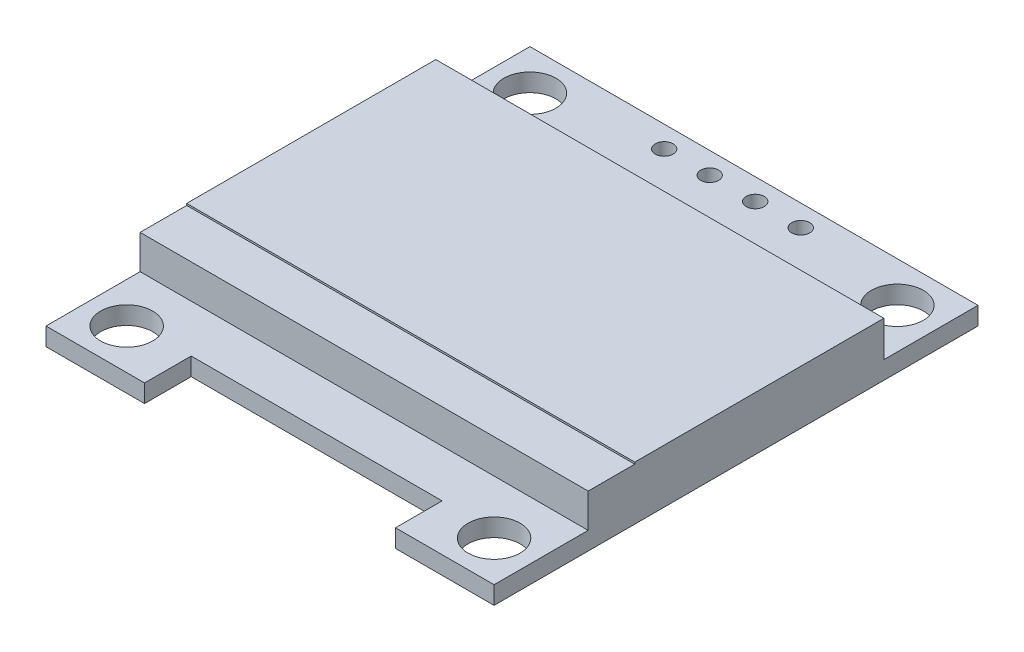
ISO-10303-21;
HEADER;
FILE_DESCRIPTION(('STEP AP214'),'2;1');
FILE_NAME('part.step','',(''),(''),'','','');
FILE_SCHEMA(('AUTOMOTIVE_DESIGN { 1 0 10303 214 1 1 1 1 }'));
ENDSEC;
DATA;
#1=APPLICATION_CONTEXT('core data for automotive mechanical design processes');
#2=APPLICATION_PROTOCOL_DEFINITION('international standard','automotive_design',2000,#1);
#3=PRODUCT_CONTEXT('',#1,'mechanical');
#4=PRODUCT('Part','Part','',(#3));
#5=PRODUCT_RELATED_PRODUCT_CATEGORY('part','',(#4));
#6=PRODUCT_DEFINITION_FORMATION('','',#4);
#7=PRODUCT_DEFINITION_CONTEXT('part definition',#1,'design');
#8=PRODUCT_DEFINITION('design','',#6,#7);
#9=PRODUCT_DEFINITION_SHAPE('','',#8);
#10=(LENGTH_UNIT() NAMED_UNIT(*) SI_UNIT(.MILLI.,.METRE.));
#11=(NAMED_UNIT(*) PLANE_ANGLE_UNIT() SI_UNIT($,.RADIAN.));
#12=(NAMED_UNIT(*) SI_UNIT($,.STERADIAN.) SOLID_ANGLE_UNIT());
#13=UNCERTAINTY_MEASURE_WITH_UNIT(LENGTH_MEASURE(1.E-05),#10,'distance_accuracy_value','');
#14=(GEOMETRIC_REPRESENTATION_CONTEXT(3) GLOBAL_UNCERTAINTY_ASSIGNED_CONTEXT((#13)) GLOBAL_UNIT_ASSIGNED_CONTEXT((#10,
#11,#12)) REPRESENTATION_CONTEXT('',''));
#15=CARTESIAN_POINT('',(0.,0.,0.));
#16=DIRECTION('',(0.,0.,1.));
#17=DIRECTION('',(1.,0.,0.));
#18=AXIS2_PLACEMENT_3D('',#15,#16,#17);
#19=CARTESIAN_POINT('',(-12.5,1.,13.5));
#20=DIRECTION('',(0.,0.,-1.));
#21=DIRECTION('',(-1.,0.,0.));
#22=AXIS2_PLACEMENT_3D('',#19,#20,#21);
#23=PLANE('',#22);
#24=DIRECTION('',(1.,0.,0.));
#25=VECTOR('',#24,1.);
#26=CARTESIAN_POINT('',(-12.5,0.,13.5));
#27=LINE('',#26,#25);
#28=CARTESIAN_POINT('',(-12.5,0.,13.5));
#29=VERTEX_POINT('',#28);
#30=CARTESIAN_POINT('',(-7.,0.,13.5));
#31=VERTEX_POINT('',#30);
#32=EDGE_CURVE('E330',#29,#31,#27,.T.);
#33=ORIENTED_EDGE('',*,*,#32,.T.);
#34=DIRECTION('',(0.,1.,0.));
#35=VECTOR('',#34,1.);
#36=CARTESIAN_POINT('',(-7.,0.,13.5));
#37=LINE('',#36,#35);
#38=CARTESIAN_POINT('',(-7.,1.,13.5));
#39=VERTEX_POINT('',#38);
#40=EDGE_CURVE('E256',#31,#39,#37,.T.);
#41=ORIENTED_EDGE('',*,*,#40,.T.);
#42=DIRECTION('',(1.,0.,0.));
#43=VECTOR('',#42,1.);
#44=CARTESIAN_POINT('',(-12.5,1.,13.5));
#45=LINE('',#44,#43);
#46=CARTESIAN_POINT('',(-12.5,1.,13.5));
#47=VERTEX_POINT('',#46);
#48=EDGE_CURVE('E320',#47,#39,#45,.T.);
#49=ORIENTED_EDGE('',*,*,#48,.F.);
#50=DIRECTION('',(0.,-1.,0.));
#51=VECTOR('',#50,1.);
#52=CARTESIAN_POINT('',(-12.5,1.,13.5));
#53=LINE('',#52,#51);
#54=EDGE_CURVE('E335',#47,#29,#53,.T.);
#55=ORIENTED_EDGE('',*,*,#54,.T.);
#56=EDGE_LOOP('',(#33,#41,#49,#55));
#57=FACE_BOUND('',#56,.T.);
#58=ADVANCED_FACE('F35',(#57),#23,.F.);
#59=CARTESIAN_POINT('',(0.,2.9,0.));
#60=DIRECTION('',(0.,1.,0.));
#61=DIRECTION('',(0.,0.,1.));
#62=AXIS2_PLACEMENT_3D('',#59,#60,#61);
#63=PLANE('',#62);
#64=DIRECTION('',(0.,0.,-1.));
#65=VECTOR('',#64,1.);
#66=CARTESIAN_POINT('',(12.5,2.9,0.));
#67=LINE('',#66,#65);
#68=CARTESIAN_POINT('',(12.5,2.9,8.25));
#69=VERTEX_POINT('',#68);
#70=CARTESIAN_POINT('',(12.5,2.9,5.65));
#71=VERTEX_POINT('',#70);
#72=EDGE_CURVE('E291',#69,#71,#67,.T.);
#73=ORIENTED_EDGE('',*,*,#72,.T.);
#74=DIRECTION('',(-1.,0.,0.));
#75=VECTOR('',#74,1.);
#76=CARTESIAN_POINT('',(0.,2.9,5.65));
#77=LINE('',#76,#75);
#78=CARTESIAN_POINT('',(-12.5,2.9,5.65));
#79=VERTEX_POINT('',#78);
#80=EDGE_CURVE('E11',#71,#79,#77,.T.);
#81=ORIENTED_EDGE('',*,*,#80,.T.);
#82=DIRECTION('',(0.,0.,1.));
#83=VECTOR('',#82,1.);
#84=CARTESIAN_POINT('',(-12.5,2.9,0.));
#85=LINE('',#84,#83);
#86=CARTESIAN_POINT('',(-12.5,2.9,8.25));
#87=VERTEX_POINT('',#86);
#88=EDGE_CURVE('E287',#79,#87,#85,.T.);
#89=ORIENTED_EDGE('',*,*,#88,.T.);
#90=DIRECTION('',(1.,0.,0.));
#91=VECTOR('',#90,1.);
#92=CARTESIAN_POINT('',(0.,2.9,8.25));
#93=LINE('',#92,#91);
#94=EDGE_CURVE('E289',#87,#69,#93,.T.);
#95=ORIENTED_EDGE('',*,*,#94,.T.);
#96=EDGE_LOOP('',(#73,#81,#89,#95));
#97=FACE_BOUND('',#96,.T.);
#98=ADVANCED_FACE('F376',(#97),#63,.T.);
#99=CARTESIAN_POINT('',(0.,1.,0.));
#100=DIRECTION('',(0.,1.,0.));
#101=DIRECTION('',(0.,0.,1.));
#102=AXIS2_PLACEMENT_3D('',#99,#100,#101);
#103=PLANE('',#102);
#104=CARTESIAN_POINT('',(-3.81,1.,-12.3));
#105=DIRECTION('',(0.,1.,0.));
#106=DIRECTION('',(0.,0.,1.));
#107=AXIS2_PLACEMENT_3D('',#104,#105,#106);
#108=CIRCLE('',#107,0.500000000000001);
#109=CARTESIAN_POINT('',(-3.81,1.,-11.8));
#110=VERTEX_POINT('',#109);
#111=EDGE_CURVE('E203',#110,#110,#108,.T.);
#112=ORIENTED_EDGE('',*,*,#111,.F.);
#113=EDGE_LOOP('',(#112));
#114=FACE_BOUND('',#113,.T.);
#115=CARTESIAN_POINT('',(10.25,1.,-11.25));
#116=DIRECTION('',(0.,1.,0.));
#117=DIRECTION('',(0.,0.,-1.));
#118=AXIS2_PLACEMENT_3D('',#115,#116,#117);
#119=CIRCLE('',#118,1.45);
#120=CARTESIAN_POINT('',(10.25,1.,-12.7));
#121=VERTEX_POINT('',#120);
#122=EDGE_CURVE('E234',#121,#121,#119,.T.);
#123=ORIENTED_EDGE('',*,*,#122,.F.);
#124=EDGE_LOOP('',(#123));
#125=FACE_BOUND('',#124,.T.);
#126=CARTESIAN_POINT('',(-1.27,1.,-12.3));
#127=DIRECTION('',(0.,1.,0.));
#128=DIRECTION('',(0.,0.,1.));
#129=AXIS2_PLACEMENT_3D('',#126,#127,#128);
#130=CIRCLE('',#129,0.500000000000001);
#131=CARTESIAN_POINT('',(-1.27,1.,-11.8));
#132=VERTEX_POINT('',#131);
#133=EDGE_CURVE('E204',#132,#132,#130,.T.);
#134=ORIENTED_EDGE('',*,*,#133,.F.);
#135=EDGE_LOOP('',(#134));
#136=FACE_BOUND('',#135,.T.);
#137=CARTESIAN_POINT('',(1.27,1.,-12.3));
#138=DIRECTION('',(0.,1.,0.));
#139=DIRECTION('',(0.,0.,1.));
#140=AXIS2_PLACEMENT_3D('',#137,#138,#139);
#141=CIRCLE('',#140,0.500000000000001);
#142=CARTESIAN_POINT('',(1.27,1.,-11.8));
#143=VERTEX_POINT('',#142);
#144=EDGE_CURVE('E210',#143,#143,#141,.T.);
#145=ORIENTED_EDGE('',*,*,#144,.F.);
#146=EDGE_LOOP('',(#145));
#147=FACE_BOUND('',#146,.T.);
#148=CARTESIAN_POINT('',(3.81,1.,-12.3));
#149=DIRECTION('',(0.,1.,0.));
#150=DIRECTION('',(0.,0.,1.));
#151=AXIS2_PLACEMENT_3D('',#148,#149,#150);
#152=CIRCLE('',#151,0.500000000000002);
#153=CARTESIAN_POINT('',(3.81,1.,-11.8));
#154=VERTEX_POINT('',#153);
#155=EDGE_CURVE('E199',#154,#154,#152,.T.);
#156=ORIENTED_EDGE('',*,*,#155,.F.);
#157=EDGE_LOOP('',(#156));
#158=FACE_BOUND('',#157,.T.);
#159=CARTESIAN_POINT('',(-10.25,1.,-11.25));
#160=DIRECTION('',(0.,1.,0.));
#161=DIRECTION('',(0.,0.,1.));
#162=AXIS2_PLACEMENT_3D('',#159,#160,#161);
#163=CIRCLE('',#162,1.45);
#164=CARTESIAN_POINT('',(-10.25,1.,-9.8));
#165=VERTEX_POINT('',#164);
#166=EDGE_CURVE('E233',#165,#165,#163,.T.);
#167=ORIENTED_EDGE('',*,*,#166,.F.);
#168=EDGE_LOOP('',(#167));
#169=FACE_BOUND('',#168,.T.);
#170=DIRECTION('',(0.,0.,1.));
#171=VECTOR('',#170,1.);
#172=CARTESIAN_POINT('',(-12.5,1.,-13.5));
#173=LINE('',#172,#171);
#174=CARTESIAN_POINT('',(-12.5,1.,-13.5));
#175=VERTEX_POINT('',#174);
#176=CARTESIAN_POINT('',(-12.5,1.,-8.25));
#177=VERTEX_POINT('',#176);
#178=EDGE_CURVE('E317',#175,#177,#173,.T.);
#179=ORIENTED_EDGE('',*,*,#178,.T.);
#180=DIRECTION('',(1.,0.,0.));
#181=VECTOR('',#180,1.);
#182=CARTESIAN_POINT('',(0.,1.,-8.25));
#183=LINE('',#182,#181);
#184=CARTESIAN_POINT('',(12.5,1.,-8.25));
#185=VERTEX_POINT('',#184);
#186=EDGE_CURVE('E307',#177,#185,#183,.T.);
#187=ORIENTED_EDGE('',*,*,#186,.T.);
#188=DIRECTION('',(0.,0.,-1.));
#189=VECTOR('',#188,1.);
#190=CARTESIAN_POINT('',(12.5,1.,-13.5));
#191=LINE('',#190,#189);
#192=CARTESIAN_POINT('',(12.5,1.,-13.5));
#193=VERTEX_POINT('',#192);
#194=EDGE_CURVE('E314',#185,#193,#191,.T.);
#195=ORIENTED_EDGE('',*,*,#194,.T.);
#196=DIRECTION('',(-1.,0.,0.));
#197=VECTOR('',#196,1.);
#198=CARTESIAN_POINT('',(-12.5,1.,-13.5));
#199=LINE('',#198,#197);
#200=EDGE_CURVE('E313',#193,#175,#199,.T.);
#201=ORIENTED_EDGE('',*,*,#200,.T.);
#202=EDGE_LOOP('',(#179,#187,#195,#201));
#203=FACE_BOUND('',#202,.T.);
#204=ADVANCED_FACE('F392',(#114,#125,#136,#147,#158,#169,#203),#103,.T.);
#205=CARTESIAN_POINT('',(10.25,1.,11.25));
#206=DIRECTION('',(0.,1.,0.));
#207=DIRECTION('',(0.,0.,1.));
#208=AXIS2_PLACEMENT_3D('',#205,#206,#207);
#209=CIRCLE('',#208,1.45);
#210=CARTESIAN_POINT('',(10.25,1.,12.7));
#211=VERTEX_POINT('',#210);
#212=EDGE_CURVE('E222',#211,#211,#209,.T.);
#213=ORIENTED_EDGE('',*,*,#212,.F.);
#214=EDGE_LOOP('',(#213));
#215=FACE_BOUND('',#214,.T.);
#216=CARTESIAN_POINT('',(-10.25,1.,11.25));
#217=DIRECTION('',(0.,1.,0.));
#218=DIRECTION('',(0.,0.,-1.));
#219=AXIS2_PLACEMENT_3D('',#216,#217,#218);
#220=CIRCLE('',#219,1.45);
#221=CARTESIAN_POINT('',(-10.25,1.,9.8));
#222=VERTEX_POINT('',#221);
#223=EDGE_CURVE('E221',#222,#222,#220,.T.);
#224=ORIENTED_EDGE('',*,*,#223,.F.);
#225=EDGE_LOOP('',(#224));
#226=FACE_BOUND('',#225,.T.);
#227=DIRECTION('',(0.,0.,1.));
#228=VECTOR('',#227,1.);
#229=CARTESIAN_POINT('',(-7.,1.,10.9));
#230=LINE('',#229,#228);
#231=CARTESIAN_POINT('',(-7.,1.,10.9));
#232=VERTEX_POINT('',#231);
#233=EDGE_CURVE('E245',#232,#39,#230,.T.);
#234=ORIENTED_EDGE('',*,*,#233,.F.);
#235=DIRECTION('',(-1.,0.,0.));
#236=VECTOR('',#235,1.);
#237=CARTESIAN_POINT('',(-7.,1.,10.9));
#238=LINE('',#237,#236);
#239=CARTESIAN_POINT('',(7.,1.,10.9));
#240=VERTEX_POINT('',#239);
#241=EDGE_CURVE('E252',#240,#232,#238,.T.);
#242=ORIENTED_EDGE('',*,*,#241,.F.);
#243=DIRECTION('',(0.,0.,-1.));
#244=VECTOR('',#243,1.);
#245=CARTESIAN_POINT('',(7.,1.,10.9));
#246=LINE('',#245,#244);
#247=CARTESIAN_POINT('',(7.,1.,13.5));
#248=VERTEX_POINT('',#247);
#249=EDGE_CURVE('E258',#248,#240,#246,.T.);
#250=ORIENTED_EDGE('',*,*,#249,.F.);
#251=CARTESIAN_POINT('',(12.5,1.,13.5));
#252=VERTEX_POINT('',#251);
#253=EDGE_CURVE('E319',#248,#252,#45,.T.);
#254=ORIENTED_EDGE('',*,*,#253,.T.);
#255=CARTESIAN_POINT('',(12.5,1.,8.25));
#256=VERTEX_POINT('',#255);
#257=EDGE_CURVE('E311',#252,#256,#191,.T.);
#258=ORIENTED_EDGE('',*,*,#257,.T.);
#259=DIRECTION('',(-1.,0.,0.));
#260=VECTOR('',#259,1.);
#261=CARTESIAN_POINT('',(0.,1.,8.25));
#262=LINE('',#261,#260);
#263=CARTESIAN_POINT('',(-12.5,1.,8.25));
#264=VERTEX_POINT('',#263);
#265=EDGE_CURVE('E305',#256,#264,#262,.T.);
#266=ORIENTED_EDGE('',*,*,#265,.T.);
#267=EDGE_CURVE('E316',#264,#47,#173,.T.);
#268=ORIENTED_EDGE('',*,*,#267,.T.);
#269=ORIENTED_EDGE('',*,*,#48,.T.);
#270=EDGE_LOOP('',(#234,#242,#250,#254,#258,#266,#268,#269));
#271=FACE_BOUND('',#270,.T.);
#272=ADVANCED_FACE('F365',(#215,#226,#271),#103,.T.);
#273=CARTESIAN_POINT('',(12.5,1.,-13.5));
#274=DIRECTION('',(-1.,0.,0.));
#275=DIRECTION('',(0.,0.,1.));
#276=AXIS2_PLACEMENT_3D('',#273,#274,#275);
#277=PLANE('',#276);
#278=DIRECTION('',(0.,0.,-1.));
#279=VECTOR('',#278,1.);
#280=CARTESIAN_POINT('',(12.5,0.,-13.5));
#281=LINE('',#280,#279);
#282=CARTESIAN_POINT('',(12.5,0.,13.5));
#283=VERTEX_POINT('',#282);
#284=CARTESIAN_POINT('',(12.5,0.,-13.5));
#285=VERTEX_POINT('',#284);
#286=EDGE_CURVE('E310',#283,#285,#281,.T.);
#287=ORIENTED_EDGE('',*,*,#286,.T.);
#288=DIRECTION('',(0.,-1.,0.));
#289=VECTOR('',#288,1.);
#290=CARTESIAN_POINT('',(12.5,1.,-13.5));
#291=LINE('',#290,#289);
#292=EDGE_CURVE('E43',#193,#285,#291,.T.);
#293=ORIENTED_EDGE('',*,*,#292,.F.);
#294=ORIENTED_EDGE('',*,*,#194,.F.);
#295=DIRECTION('',(0.,-1.,0.));
#296=VECTOR('',#295,1.);
#297=CARTESIAN_POINT('',(12.5,2.9,-8.25));
#298=LINE('',#297,#296);
#299=CARTESIAN_POINT('',(12.5,3.,-8.25));
#300=VERTEX_POINT('',#299);
#301=EDGE_CURVE('E293',#300,#185,#298,.T.);
#302=ORIENTED_EDGE('',*,*,#301,.F.);
#303=DIRECTION('',(0.,0.,-1.));
#304=VECTOR('',#303,1.);
#305=CARTESIAN_POINT('',(12.5,3.,0.));
#306=LINE('',#305,#304);
#307=CARTESIAN_POINT('',(12.5,3.,5.65));
#308=VERTEX_POINT('',#307);
#309=EDGE_CURVE('E278',#308,#300,#306,.T.);
#310=ORIENTED_EDGE('',*,*,#309,.F.);
#311=DIRECTION('',(0.,-1.,0.));
#312=VECTOR('',#311,1.);
#313=CARTESIAN_POINT('',(12.5,3.,5.65));
#314=LINE('',#313,#312);
#315=EDGE_CURVE('E281',#308,#71,#314,.T.);
#316=ORIENTED_EDGE('',*,*,#315,.T.);
#317=ORIENTED_EDGE('',*,*,#72,.F.);
#318=DIRECTION('',(0.,-1.,0.));
#319=VECTOR('',#318,1.);
#320=CARTESIAN_POINT('',(12.5,2.9,8.25));
#321=LINE('',#320,#319);
#322=EDGE_CURVE('E296',#69,#256,#321,.T.);
#323=ORIENTED_EDGE('',*,*,#322,.T.);
#324=ORIENTED_EDGE('',*,*,#257,.F.);
#325=DIRECTION('',(0.,-1.,0.));
#326=VECTOR('',#325,1.);
#327=CARTESIAN_POINT('',(12.5,1.,13.5));
#328=LINE('',#327,#326);
#329=EDGE_CURVE('E323',#252,#283,#328,.T.);
#330=ORIENTED_EDGE('',*,*,#329,.T.);
#331=EDGE_LOOP('',(#287,#293,#294,#302,#310,#316,#317,#323,#324,#330));
#332=FACE_BOUND('',#331,.T.);
#333=ADVANCED_FACE('F37',(#332),#277,.F.);
#334=CARTESIAN_POINT('',(-12.5,1.,-13.5));
#335=DIRECTION('',(0.,0.,1.));
#336=DIRECTION('',(1.,0.,0.));
#337=AXIS2_PLACEMENT_3D('',#334,#335,#336);
#338=PLANE('',#337);
#339=DIRECTION('',(-1.,0.,0.));
#340=VECTOR('',#339,1.);
#341=CARTESIAN_POINT('',(-12.5,0.,-13.5));
#342=LINE('',#341,#340);
#343=CARTESIAN_POINT('',(-12.5,0.,-13.5));
#344=VERTEX_POINT('',#343);
#345=EDGE_CURVE('E325',#285,#344,#342,.T.);
#346=ORIENTED_EDGE('',*,*,#345,.T.);
#347=DIRECTION('',(0.,-1.,0.));
#348=VECTOR('',#347,1.);
#349=CARTESIAN_POINT('',(-12.5,1.,-13.5));
#350=LINE('',#349,#348);
#351=EDGE_CURVE('E338',#175,#344,#350,.T.);
#352=ORIENTED_EDGE('',*,*,#351,.F.);
#353=ORIENTED_EDGE('',*,*,#200,.F.);
#354=ORIENTED_EDGE('',*,*,#292,.T.);
#355=EDGE_LOOP('',(#346,#352,#353,#354));
#356=FACE_BOUND('',#355,.T.);
#357=ADVANCED_FACE('F344',(#356),#338,.F.);
#358=CARTESIAN_POINT('',(-12.5,1.,-13.5));
#359=DIRECTION('',(1.,0.,0.));
#360=DIRECTION('',(0.,0.,-1.));
#361=AXIS2_PLACEMENT_3D('',#358,#359,#360);
#362=PLANE('',#361);
#363=DIRECTION('',(0.,-1.,0.));
#364=VECTOR('',#363,1.);
#365=CARTESIAN_POINT('',(-12.5,2.9,-8.25));
#366=LINE('',#365,#364);
#367=CARTESIAN_POINT('',(-12.5,3.,-8.25));
#368=VERTEX_POINT('',#367);
#369=EDGE_CURVE('E302',#368,#177,#366,.T.);
#370=ORIENTED_EDGE('',*,*,#369,.T.);
#371=ORIENTED_EDGE('',*,*,#178,.F.);
#372=ORIENTED_EDGE('',*,*,#351,.T.);
#373=DIRECTION('',(0.,0.,1.));
#374=VECTOR('',#373,1.);
#375=CARTESIAN_POINT('',(-12.5,0.,-13.5));
#376=LINE('',#375,#374);
#377=EDGE_CURVE('E327',#344,#29,#376,.T.);
#378=ORIENTED_EDGE('',*,*,#377,.T.);
#379=ORIENTED_EDGE('',*,*,#54,.F.);
#380=ORIENTED_EDGE('',*,*,#267,.F.);
#381=DIRECTION('',(0.,-1.,0.));
#382=VECTOR('',#381,1.);
#383=CARTESIAN_POINT('',(-12.5,2.9,8.25));
#384=LINE('',#383,#382);
#385=EDGE_CURVE('E299',#87,#264,#384,.T.);
#386=ORIENTED_EDGE('',*,*,#385,.F.);
#387=ORIENTED_EDGE('',*,*,#88,.F.);
#388=DIRECTION('',(0.,-1.,0.));
#389=VECTOR('',#388,1.);
#390=CARTESIAN_POINT('',(-12.5,3.,5.65));
#391=LINE('',#390,#389);
#392=CARTESIAN_POINT('',(-12.5,3.,5.65));
#393=VERTEX_POINT('',#392);
#394=EDGE_CURVE('E284',#393,#79,#391,.T.);
#395=ORIENTED_EDGE('',*,*,#394,.F.);
#396=DIRECTION('',(0.,0.,1.));
#397=VECTOR('',#396,1.);
#398=CARTESIAN_POINT('',(-12.5,3.,0.));
#399=LINE('',#398,#397);
#400=EDGE_CURVE('E274',#368,#393,#399,.T.);
#401=ORIENTED_EDGE('',*,*,#400,.F.);
#402=EDGE_LOOP('',(#370,#371,#372,#378,#379,#380,#386,#387,#395,#401));
#403=FACE_BOUND('',#402,.T.);
#404=ADVANCED_FACE('F358',(#403),#362,.F.);
#405=ORIENTED_EDGE('',*,*,#253,.F.);
#406=DIRECTION('',(0.,1.,0.));
#407=VECTOR('',#406,1.);
#408=CARTESIAN_POINT('',(7.,0.,13.5));
#409=LINE('',#408,#407);
#410=CARTESIAN_POINT('',(7.,0.,13.5));
#411=VERTEX_POINT('',#410);
#412=EDGE_CURVE('E268',#411,#248,#409,.T.);
#413=ORIENTED_EDGE('',*,*,#412,.F.);
#414=EDGE_CURVE('E329',#411,#283,#27,.T.);
#415=ORIENTED_EDGE('',*,*,#414,.T.);
#416=ORIENTED_EDGE('',*,*,#329,.F.);
#417=EDGE_LOOP('',(#405,#413,#415,#416));
#418=FACE_BOUND('',#417,.T.);
#419=ADVANCED_FACE('F409',(#418),#23,.F.);
#420=CARTESIAN_POINT('',(0.,0.,0.));
#421=DIRECTION('',(0.,1.,0.));
#422=DIRECTION('',(0.,0.,1.));
#423=AXIS2_PLACEMENT_3D('',#420,#421,#422);
#424=PLANE('',#423);
#425=DIRECTION('',(1.,0.,0.));
#426=VECTOR('',#425,1.);
#427=CARTESIAN_POINT('',(0.,0.,-2.69231460674157));
#428=LINE('',#427,#426);
#429=CARTESIAN_POINT('',(-3.88314606741573,0.,-2.69231460674157));
#430=VERTEX_POINT('',#429);
#431=CARTESIAN_POINT('',(-3.26184269662921,0.,-2.69231460674157));
#432=VERTEX_POINT('',#431);
#433=EDGE_CURVE('E194',#430,#432,#428,.T.);
#434=ORIENTED_EDGE('',*,*,#433,.T.);
#435=DIRECTION('',(0.,0.,-1.));
#436=VECTOR('',#435,1.);
#437=CARTESIAN_POINT('',(-3.26184269662921,0.,0.));
#438=LINE('',#437,#436);
#439=CARTESIAN_POINT('',(-3.26184269662921,0.,-4.81510112359551));
#440=VERTEX_POINT('',#439);
#441=EDGE_CURVE('E197',#432,#440,#438,.T.);
#442=ORIENTED_EDGE('',*,*,#441,.T.);
#443=DIRECTION('',(-1.,0.,0.));
#444=VECTOR('',#443,1.);
#445=CARTESIAN_POINT('',(0.,0.,-4.81510112359551));
#446=LINE('',#445,#444);
#447=CARTESIAN_POINT('',(-3.88314606741573,0.,-4.81510112359551));
#448=VERTEX_POINT('',#447);
#449=EDGE_CURVE('E162',#440,#448,#446,.T.);
#450=ORIENTED_EDGE('',*,*,#449,.T.);
#451=DIRECTION('',(0.,0.,1.));
#452=VECTOR('',#451,1.);
#453=CARTESIAN_POINT('',(-3.88314606741573,0.,0.));
#454=LINE('',#453,#452);
#455=EDGE_CURVE('E191',#448,#430,#454,.T.);
#456=ORIENTED_EDGE('',*,*,#455,.T.);
#457=EDGE_LOOP('',(#434,#442,#450,#456));
#458=FACE_BOUND('',#457,.T.);
#459=CARTESIAN_POINT('',(-3.81,0.,-12.3));
#460=DIRECTION('',(0.,1.,0.));
#461=DIRECTION('',(0.,0.,1.));
#462=AXIS2_PLACEMENT_3D('',#459,#460,#461);
#463=CIRCLE('',#462,0.500000000000001);
#464=CARTESIAN_POINT('',(-3.81,0.,-11.8));
#465=VERTEX_POINT('',#464);
#466=EDGE_CURVE('E225',#465,#465,#463,.T.);
#467=ORIENTED_EDGE('',*,*,#466,.T.);
#468=EDGE_LOOP('',(#467));
#469=FACE_BOUND('',#468,.T.);
#470=CARTESIAN_POINT('',(10.25,0.,11.25));
#471=DIRECTION('',(0.,1.,0.));
#472=DIRECTION('',(0.,0.,1.));
#473=AXIS2_PLACEMENT_3D('',#470,#471,#472);
#474=CIRCLE('',#473,1.45);
#475=CARTESIAN_POINT('',(10.25,0.,12.7));
#476=VERTEX_POINT('',#475);
#477=EDGE_CURVE('E218',#476,#476,#474,.T.);
#478=ORIENTED_EDGE('',*,*,#477,.T.);
#479=EDGE_LOOP('',(#478));
#480=FACE_BOUND('',#479,.T.);
#481=CARTESIAN_POINT('',(-10.25,0.,11.25));
#482=DIRECTION('',(0.,1.,0.));
#483=DIRECTION('',(0.,0.,-1.));
#484=AXIS2_PLACEMENT_3D('',#481,#482,#483);
#485=CIRCLE('',#484,1.45);
#486=CARTESIAN_POINT('',(-10.25,0.,9.8));
#487=VERTEX_POINT('',#486);
#488=EDGE_CURVE('E237',#487,#487,#485,.T.);
#489=ORIENTED_EDGE('',*,*,#488,.T.);
#490=EDGE_LOOP('',(#489));
#491=FACE_BOUND('',#490,.T.);
#492=CARTESIAN_POINT('',(10.25,0.,-11.25));
#493=DIRECTION('',(0.,1.,0.));
#494=DIRECTION('',(0.,0.,-1.));
#495=AXIS2_PLACEMENT_3D('',#492,#493,#494);
#496=CIRCLE('',#495,1.45);
#497=CARTESIAN_POINT('',(10.25,0.,-12.7));
#498=VERTEX_POINT('',#497);
#499=EDGE_CURVE('E230',#498,#498,#496,.T.);
#500=ORIENTED_EDGE('',*,*,#499,.T.);
#501=EDGE_LOOP('',(#500));
#502=FACE_BOUND('',#501,.T.);
#503=CARTESIAN_POINT('',(-1.27,0.,-12.3));
#504=DIRECTION('',(0.,1.,0.));
#505=DIRECTION('',(0.,0.,1.));
#506=AXIS2_PLACEMENT_3D('',#503,#504,#505);
#507=CIRCLE('',#506,0.500000000000001);
#508=CARTESIAN_POINT('',(-1.27,0.,-11.8));
#509=VERTEX_POINT('',#508);
#510=EDGE_CURVE('E200',#509,#509,#507,.T.);
#511=ORIENTED_EDGE('',*,*,#510,.T.);
#512=EDGE_LOOP('',(#511));
#513=FACE_BOUND('',#512,.T.);
#514=CARTESIAN_POINT('',(1.27,0.,-12.3));
#515=DIRECTION('',(0.,1.,0.));
#516=DIRECTION('',(0.,0.,1.));
#517=AXIS2_PLACEMENT_3D('',#514,#515,#516);
#518=CIRCLE('',#517,0.500000000000001);
#519=CARTESIAN_POINT('',(1.27,0.,-11.8));
#520=VERTEX_POINT('',#519);
#521=EDGE_CURVE('E207',#520,#520,#518,.T.);
#522=ORIENTED_EDGE('',*,*,#521,.T.);
#523=EDGE_LOOP('',(#522));
#524=FACE_BOUND('',#523,.T.);
#525=CARTESIAN_POINT('',(3.81,0.,-12.3));
#526=DIRECTION('',(0.,1.,0.));
#527=DIRECTION('',(0.,0.,1.));
#528=AXIS2_PLACEMENT_3D('',#525,#526,#527);
#529=CIRCLE('',#528,0.500000000000002);
#530=CARTESIAN_POINT('',(3.81,0.,-11.8));
#531=VERTEX_POINT('',#530);
#532=EDGE_CURVE('E213',#531,#531,#529,.T.);
#533=ORIENTED_EDGE('',*,*,#532,.T.);
#534=EDGE_LOOP('',(#533));
#535=FACE_BOUND('',#534,.T.);
#536=CARTESIAN_POINT('',(-10.25,0.,-11.25));
#537=DIRECTION('',(0.,1.,0.));
#538=DIRECTION('',(0.,0.,1.));
#539=AXIS2_PLACEMENT_3D('',#536,#537,#538);
#540=CIRCLE('',#539,1.45);
#541=CARTESIAN_POINT('',(-10.25,0.,-9.8));
#542=VERTEX_POINT('',#541);
#543=EDGE_CURVE('E242',#542,#542,#540,.T.);
#544=ORIENTED_EDGE('',*,*,#543,.T.);
#545=EDGE_LOOP('',(#544));
#546=FACE_BOUND('',#545,.T.);
#547=DIRECTION('',(-1.,0.,0.));
#548=VECTOR('',#547,1.);
#549=CARTESIAN_POINT('',(-7.,0.,10.9));
#550=LINE('',#549,#548);
#551=CARTESIAN_POINT('',(7.,0.,10.9));
#552=VERTEX_POINT('',#551);
#553=CARTESIAN_POINT('',(-7.,0.,10.9));
#554=VERTEX_POINT('',#553);
#555=EDGE_CURVE('E58',#552,#554,#550,.T.);
#556=ORIENTED_EDGE('',*,*,#555,.T.);
#557=DIRECTION('',(0.,0.,1.));
#558=VECTOR('',#557,1.);
#559=CARTESIAN_POINT('',(-7.,0.,10.9));
#560=LINE('',#559,#558);
#561=EDGE_CURVE('E248',#554,#31,#560,.T.);
#562=ORIENTED_EDGE('',*,*,#561,.T.);
#563=ORIENTED_EDGE('',*,*,#32,.F.);
#564=ORIENTED_EDGE('',*,*,#377,.F.);
#565=ORIENTED_EDGE('',*,*,#345,.F.);
#566=ORIENTED_EDGE('',*,*,#286,.F.);
#567=ORIENTED_EDGE('',*,*,#414,.F.);
#568=DIRECTION('',(0.,0.,-1.));
#569=VECTOR('',#568,1.);
#570=CARTESIAN_POINT('',(7.,0.,10.9));
#571=LINE('',#570,#569);
#572=EDGE_CURVE('E251',#411,#552,#571,.T.);
#573=ORIENTED_EDGE('',*,*,#572,.T.);
#574=EDGE_LOOP('',(#556,#562,#563,#564,#565,#566,#567,#573));
#575=FACE_BOUND('',#574,.T.);
#576=ADVANCED_FACE('F354',(#458,#469,#480,#491,#502,#513,#524,#535,#546,#575),#424,.F.);
#577=CARTESIAN_POINT('',(0.,2.9,-8.25));
#578=DIRECTION('',(0.,0.,1.));
#579=DIRECTION('',(1.,0.,0.));
#580=AXIS2_PLACEMENT_3D('',#577,#578,#579);
#581=PLANE('',#580);
#582=ORIENTED_EDGE('',*,*,#186,.F.);
#583=ORIENTED_EDGE('',*,*,#369,.F.);
#584=DIRECTION('',(-1.,0.,0.));
#585=VECTOR('',#584,1.);
#586=CARTESIAN_POINT('',(0.,3.,-8.25));
#587=LINE('',#586,#585);
#588=EDGE_CURVE('E265',#300,#368,#587,.T.);
#589=ORIENTED_EDGE('',*,*,#588,.F.);
#590=ORIENTED_EDGE('',*,*,#301,.T.);
#591=EDGE_LOOP('',(#582,#583,#589,#590));
#592=FACE_BOUND('',#591,.T.);
#593=ADVANCED_FACE('F390',(#592),#581,.F.);
#594=CARTESIAN_POINT('',(0.,2.9,8.25));
#595=DIRECTION('',(0.,0.,-1.));
#596=DIRECTION('',(-1.,0.,0.));
#597=AXIS2_PLACEMENT_3D('',#594,#595,#596);
#598=PLANE('',#597);
#599=ORIENTED_EDGE('',*,*,#265,.F.);
#600=ORIENTED_EDGE('',*,*,#322,.F.);
#601=ORIENTED_EDGE('',*,*,#94,.F.);
#602=ORIENTED_EDGE('',*,*,#385,.T.);
#603=EDGE_LOOP('',(#599,#600,#601,#602));
#604=FACE_BOUND('',#603,.T.);
#605=ADVANCED_FACE('F372',(#604),#598,.F.);
#606=CARTESIAN_POINT('',(0.,3.,5.65));
#607=DIRECTION('',(0.,0.,-1.));
#608=DIRECTION('',(-1.,0.,0.));
#609=AXIS2_PLACEMENT_3D('',#606,#607,#608);
#610=PLANE('',#609);
#611=ORIENTED_EDGE('',*,*,#80,.F.);
#612=ORIENTED_EDGE('',*,*,#315,.F.);
#613=DIRECTION('',(1.,0.,0.));
#614=VECTOR('',#613,1.);
#615=CARTESIAN_POINT('',(0.,3.,5.65));
#616=LINE('',#615,#614);
#617=EDGE_CURVE('E276',#393,#308,#616,.T.);
#618=ORIENTED_EDGE('',*,*,#617,.F.);
#619=ORIENTED_EDGE('',*,*,#394,.T.);
#620=EDGE_LOOP('',(#611,#612,#618,#619));
#621=FACE_BOUND('',#620,.T.);
#622=ADVANCED_FACE('F382',(#621),#610,.F.);
#623=CARTESIAN_POINT('',(0.,3.,0.));
#624=DIRECTION('',(0.,1.,0.));
#625=DIRECTION('',(0.,0.,1.));
#626=AXIS2_PLACEMENT_3D('',#623,#624,#625);
#627=PLANE('',#626);
#628=ORIENTED_EDGE('',*,*,#588,.T.);
#629=ORIENTED_EDGE('',*,*,#400,.T.);
#630=ORIENTED_EDGE('',*,*,#617,.T.);
#631=ORIENTED_EDGE('',*,*,#309,.T.);
#632=EDGE_LOOP('',(#628,#629,#630,#631));
#633=FACE_BOUND('',#632,.T.);
#634=ADVANCED_FACE('F386',(#633),#627,.T.);
#635=CARTESIAN_POINT('',(-7.,0.,10.9));
#636=DIRECTION('',(-1.,0.,0.));
#637=DIRECTION('',(0.,0.,1.));
#638=AXIS2_PLACEMENT_3D('',#635,#636,#637);
#639=PLANE('',#638);
#640=ORIENTED_EDGE('',*,*,#233,.T.);
#641=ORIENTED_EDGE('',*,*,#40,.F.);
#642=ORIENTED_EDGE('',*,*,#561,.F.);
#643=DIRECTION('',(0.,1.,0.));
#644=VECTOR('',#643,1.);
#645=CARTESIAN_POINT('',(-7.,0.,10.9));
#646=LINE('',#645,#644);
#647=EDGE_CURVE('E263',#554,#232,#646,.T.);
#648=ORIENTED_EDGE('',*,*,#647,.T.);
#649=EDGE_LOOP('',(#640,#641,#642,#648));
#650=FACE_BOUND('',#649,.T.);
#651=ADVANCED_FACE('F428',(#650),#639,.F.);
#652=CARTESIAN_POINT('',(-7.,0.,10.9));
#653=DIRECTION('',(0.,0.,-1.));
#654=DIRECTION('',(-1.,0.,0.));
#655=AXIS2_PLACEMENT_3D('',#652,#653,#654);
#656=PLANE('',#655);
#657=ORIENTED_EDGE('',*,*,#241,.T.);
#658=ORIENTED_EDGE('',*,*,#647,.F.);
#659=ORIENTED_EDGE('',*,*,#555,.F.);
#660=DIRECTION('',(0.,1.,0.));
#661=VECTOR('',#660,1.);
#662=CARTESIAN_POINT('',(7.,0.,10.9));
#663=LINE('',#662,#661);
#664=EDGE_CURVE('E266',#552,#240,#663,.T.);
#665=ORIENTED_EDGE('',*,*,#664,.T.);
#666=EDGE_LOOP('',(#657,#658,#659,#665));
#667=FACE_BOUND('',#666,.T.);
#668=ADVANCED_FACE('F429',(#667),#656,.F.);
#669=CARTESIAN_POINT('',(7.,0.,10.9));
#670=DIRECTION('',(1.,0.,0.));
#671=DIRECTION('',(0.,0.,-1.));
#672=AXIS2_PLACEMENT_3D('',#669,#670,#671);
#673=PLANE('',#672);
#674=ORIENTED_EDGE('',*,*,#249,.T.);
#675=ORIENTED_EDGE('',*,*,#664,.F.);
#676=ORIENTED_EDGE('',*,*,#572,.F.);
#677=ORIENTED_EDGE('',*,*,#412,.T.);
#678=EDGE_LOOP('',(#674,#675,#676,#677));
#679=FACE_BOUND('',#678,.T.);
#680=ADVANCED_FACE('F425',(#679),#673,.F.);
#681=CARTESIAN_POINT('',(-10.25,0.,-11.25));
#682=DIRECTION('',(0.,1.,0.));
#683=DIRECTION('',(0.,0.,1.));
#684=AXIS2_PLACEMENT_3D('',#681,#682,#683);
#685=CYLINDRICAL_SURFACE('',#684,1.45);
#686=ORIENTED_EDGE('',*,*,#543,.F.);
#687=EDGE_LOOP('',(#686));
#688=FACE_BOUND('',#687,.T.);
#689=ORIENTED_EDGE('',*,*,#166,.T.);
#690=EDGE_LOOP('',(#689));
#691=FACE_BOUND('',#690,.T.);
#692=ADVANCED_FACE('F436',(#688,#691),#685,.F.);
#693=CARTESIAN_POINT('',(3.81,0.,-12.3));
#694=DIRECTION('',(0.,1.,0.));
#695=DIRECTION('',(0.,0.,1.));
#696=AXIS2_PLACEMENT_3D('',#693,#694,#695);
#697=CYLINDRICAL_SURFACE('',#696,0.500000000000002);
#698=ORIENTED_EDGE('',*,*,#532,.F.);
#699=EDGE_LOOP('',(#698));
#700=FACE_BOUND('',#699,.T.);
#701=ORIENTED_EDGE('',*,*,#155,.T.);
#702=EDGE_LOOP('',(#701));
#703=FACE_BOUND('',#702,.T.);
#704=ADVANCED_FACE('F495',(#700,#703),#697,.F.);
#705=CARTESIAN_POINT('',(1.27,0.,-12.3));
#706=DIRECTION('',(0.,1.,0.));
#707=DIRECTION('',(0.,0.,1.));
#708=AXIS2_PLACEMENT_3D('',#705,#706,#707);
#709=CYLINDRICAL_SURFACE('',#708,0.500000000000001);
#710=ORIENTED_EDGE('',*,*,#521,.F.);
#711=EDGE_LOOP('',(#710));
#712=FACE_BOUND('',#711,.T.);
#713=ORIENTED_EDGE('',*,*,#144,.T.);
#714=EDGE_LOOP('',(#713));
#715=FACE_BOUND('',#714,.T.);
#716=ADVANCED_FACE('F501',(#712,#715),#709,.F.);
#717=CARTESIAN_POINT('',(-1.27,0.,-12.3));
#718=DIRECTION('',(0.,1.,0.));
#719=DIRECTION('',(0.,0.,1.));
#720=AXIS2_PLACEMENT_3D('',#717,#718,#719);
#721=CYLINDRICAL_SURFACE('',#720,0.500000000000001);
#722=ORIENTED_EDGE('',*,*,#510,.F.);
#723=EDGE_LOOP('',(#722));
#724=FACE_BOUND('',#723,.T.);
#725=ORIENTED_EDGE('',*,*,#133,.T.);
#726=EDGE_LOOP('',(#725));
#727=FACE_BOUND('',#726,.T.);
#728=ADVANCED_FACE('F509',(#724,#727),#721,.F.);
#729=CARTESIAN_POINT('',(10.25,0.,-11.25));
#730=DIRECTION('',(0.,1.,0.));
#731=DIRECTION('',(0.,0.,1.));
#732=AXIS2_PLACEMENT_3D('',#729,#730,#731);
#733=CYLINDRICAL_SURFACE('',#732,1.45);
#734=ORIENTED_EDGE('',*,*,#499,.F.);
#735=EDGE_LOOP('',(#734));
#736=FACE_BOUND('',#735,.T.);
#737=ORIENTED_EDGE('',*,*,#122,.T.);
#738=EDGE_LOOP('',(#737));
#739=FACE_BOUND('',#738,.T.);
#740=ADVANCED_FACE('F517',(#736,#739),#733,.F.);
#741=CARTESIAN_POINT('',(-10.25,0.,11.25));
#742=DIRECTION('',(0.,1.,0.));
#743=DIRECTION('',(0.,0.,1.));
#744=AXIS2_PLACEMENT_3D('',#741,#742,#743);
#745=CYLINDRICAL_SURFACE('',#744,1.45);
#746=ORIENTED_EDGE('',*,*,#488,.F.);
#747=EDGE_LOOP('',(#746));
#748=FACE_BOUND('',#747,.T.);
#749=ORIENTED_EDGE('',*,*,#223,.T.);
#750=EDGE_LOOP('',(#749));
#751=FACE_BOUND('',#750,.T.);
#752=ADVANCED_FACE('F525',(#748,#751),#745,.F.);
#753=CARTESIAN_POINT('',(10.25,0.,11.25));
#754=DIRECTION('',(0.,1.,0.));
#755=DIRECTION('',(0.,0.,1.));
#756=AXIS2_PLACEMENT_3D('',#753,#754,#755);
#757=CYLINDRICAL_SURFACE('',#756,1.45);
#758=ORIENTED_EDGE('',*,*,#477,.F.);
#759=EDGE_LOOP('',(#758));
#760=FACE_BOUND('',#759,.T.);
#761=ORIENTED_EDGE('',*,*,#212,.T.);
#762=EDGE_LOOP('',(#761));
#763=FACE_BOUND('',#762,.T.);
#764=ADVANCED_FACE('F533',(#760,#763),#757,.F.);
#765=CARTESIAN_POINT('',(-3.81,0.,-12.3));
#766=DIRECTION('',(0.,1.,0.));
#767=DIRECTION('',(0.,0.,1.));
#768=AXIS2_PLACEMENT_3D('',#765,#766,#767);
#769=CYLINDRICAL_SURFACE('',#768,0.500000000000001);
#770=ORIENTED_EDGE('',*,*,#466,.F.);
#771=EDGE_LOOP('',(#770));
#772=FACE_BOUND('',#771,.T.);
#773=ORIENTED_EDGE('',*,*,#111,.T.);
#774=EDGE_LOOP('',(#773));
#775=FACE_BOUND('',#774,.T.);
#776=ADVANCED_FACE('F540',(#772,#775),#769,.F.);
#777=CARTESIAN_POINT('',(-3.26184269662921,-1.,0.));
#778=DIRECTION('',(1.,0.,0.));
#779=DIRECTION('',(0.,0.,-1.));
#780=AXIS2_PLACEMENT_3D('',#777,#778,#779);
#781=PLANE('',#780);
#782=ORIENTED_EDGE('',*,*,#441,.F.);
#783=DIRECTION('',(0.,1.,0.));
#784=VECTOR('',#783,1.);
#785=CARTESIAN_POINT('',(-3.26184269662921,-1.,-2.69231460674157));
#786=LINE('',#785,#784);
#787=CARTESIAN_POINT('',(-3.26184269662921,-1.,-2.69231460674157));
#788=VERTEX_POINT('',#787);
#789=EDGE_CURVE('E180',#788,#432,#786,.T.);
#790=ORIENTED_EDGE('',*,*,#789,.F.);
#791=DIRECTION('',(0.,0.,-1.));
#792=VECTOR('',#791,1.);
#793=CARTESIAN_POINT('',(-3.26184269662921,-1.,0.));
#794=LINE('',#793,#792);
#795=CARTESIAN_POINT('',(-3.26184269662921,-1.,-4.81510112359551));
#796=VERTEX_POINT('',#795);
#797=EDGE_CURVE('E173',#788,#796,#794,.T.);
#798=ORIENTED_EDGE('',*,*,#797,.T.);
#799=DIRECTION('',(0.,1.,0.));
#800=VECTOR('',#799,1.);
#801=CARTESIAN_POINT('',(-3.26184269662921,-1.,-4.81510112359551));
#802=LINE('',#801,#800);
#803=EDGE_CURVE('E157',#796,#440,#802,.T.);
#804=ORIENTED_EDGE('',*,*,#803,.T.);
#805=EDGE_LOOP('',(#782,#790,#798,#804));
#806=FACE_BOUND('',#805,.T.);
#807=ADVANCED_FACE('F178',(#806),#781,.T.);
#808=CARTESIAN_POINT('',(0.,-1.,-2.69231460674157));
#809=DIRECTION('',(0.,0.,1.));
#810=DIRECTION('',(1.,0.,0.));
#811=AXIS2_PLACEMENT_3D('',#808,#809,#810);
#812=PLANE('',#811);
#813=ORIENTED_EDGE('',*,*,#433,.F.);
#814=DIRECTION('',(0.,1.,0.));
#815=VECTOR('',#814,1.);
#816=CARTESIAN_POINT('',(-3.88314606741573,-1.,-2.69231460674157));
#817=LINE('',#816,#815);
#818=CARTESIAN_POINT('',(-3.88314606741573,-1.,-2.69231460674157));
#819=VERTEX_POINT('',#818);
#820=EDGE_CURVE('E186',#819,#430,#817,.T.);
#821=ORIENTED_EDGE('',*,*,#820,.F.);
#822=DIRECTION('',(1.,0.,0.));
#823=VECTOR('',#822,1.);
#824=CARTESIAN_POINT('',(0.,-1.,-2.69231460674157));
#825=LINE('',#824,#823);
#826=EDGE_CURVE('E166',#819,#788,#825,.T.);
#827=ORIENTED_EDGE('',*,*,#826,.T.);
#828=ORIENTED_EDGE('',*,*,#789,.T.);
#829=EDGE_LOOP('',(#813,#821,#827,#828));
#830=FACE_BOUND('',#829,.T.);
#831=ADVANCED_FACE('F554',(#830),#812,.T.);
#832=CARTESIAN_POINT('',(-3.88314606741573,-1.,0.));
#833=DIRECTION('',(-1.,0.,0.));
#834=DIRECTION('',(0.,0.,1.));
#835=AXIS2_PLACEMENT_3D('',#832,#833,#834);
#836=PLANE('',#835);
#837=ORIENTED_EDGE('',*,*,#455,.F.);
#838=DIRECTION('',(0.,1.,0.));
#839=VECTOR('',#838,1.);
#840=CARTESIAN_POINT('',(-3.88314606741573,-1.,-4.81510112359551));
#841=LINE('',#840,#839);
#842=CARTESIAN_POINT('',(-3.88314606741573,-1.,-4.81510112359551));
#843=VERTEX_POINT('',#842);
#844=EDGE_CURVE('E50',#843,#448,#841,.T.);
#845=ORIENTED_EDGE('',*,*,#844,.F.);
#846=DIRECTION('',(0.,0.,1.));
#847=VECTOR('',#846,1.);
#848=CARTESIAN_POINT('',(-3.88314606741573,-1.,0.));
#849=LINE('',#848,#847);
#850=EDGE_CURVE('E176',#843,#819,#849,.T.);
#851=ORIENTED_EDGE('',*,*,#850,.T.);
#852=ORIENTED_EDGE('',*,*,#820,.T.);
#853=EDGE_LOOP('',(#837,#845,#851,#852));
#854=FACE_BOUND('',#853,.T.);
#855=ADVANCED_FACE('F561',(#854),#836,.T.);
#856=CARTESIAN_POINT('',(0.,-1.,-4.81510112359551));
#857=DIRECTION('',(0.,0.,-1.));
#858=DIRECTION('',(-1.,0.,0.));
#859=AXIS2_PLACEMENT_3D('',#856,#857,#858);
#860=PLANE('',#859);
#861=ORIENTED_EDGE('',*,*,#449,.F.);
#862=ORIENTED_EDGE('',*,*,#803,.F.);
#863=DIRECTION('',(-1.,0.,0.));
#864=VECTOR('',#863,1.);
#865=CARTESIAN_POINT('',(0.,-1.,-4.81510112359551));
#866=LINE('',#865,#864);
#867=EDGE_CURVE('E160',#796,#843,#866,.T.);
#868=ORIENTED_EDGE('',*,*,#867,.T.);
#869=ORIENTED_EDGE('',*,*,#844,.T.);
#870=EDGE_LOOP('',(#861,#862,#868,#869));
#871=FACE_BOUND('',#870,.T.);
#872=ADVANCED_FACE('F159',(#871),#860,.T.);
#873=CARTESIAN_POINT('',(0.,-1.,0.));
#874=DIRECTION('',(0.,1.,0.));
#875=DIRECTION('',(0.,0.,1.));
#876=AXIS2_PLACEMENT_3D('',#873,#874,#875);
#877=PLANE('',#876);
#878=ORIENTED_EDGE('',*,*,#797,.F.);
#879=ORIENTED_EDGE('',*,*,#826,.F.);
#880=ORIENTED_EDGE('',*,*,#850,.F.);
#881=ORIENTED_EDGE('',*,*,#867,.F.);
#882=EDGE_LOOP('',(#878,#879,#880,#881));
#883=FACE_BOUND('',#882,.T.);
#884=ADVANCED_FACE('F171',(#883),#877,.F.);
#885=CLOSED_SHELL('',(#58,#98,#204,#272,#333,#357,#404,#419,#576,#593,#605,#622,#634,#651,#668,
#680,#692,#704,#716,#728,#740,#752,#764,#776,#807,#831,#855,#872,#884));
#886=MANIFOLD_SOLID_BREP('B2',#885);
#887=ADVANCED_BREP_SHAPE_REPRESENTATION('',(#18,#886),#14);
#888=SHAPE_DEFINITION_REPRESENTATION(#9,#887);
ENDSEC;
END-ISO-10303-21;
